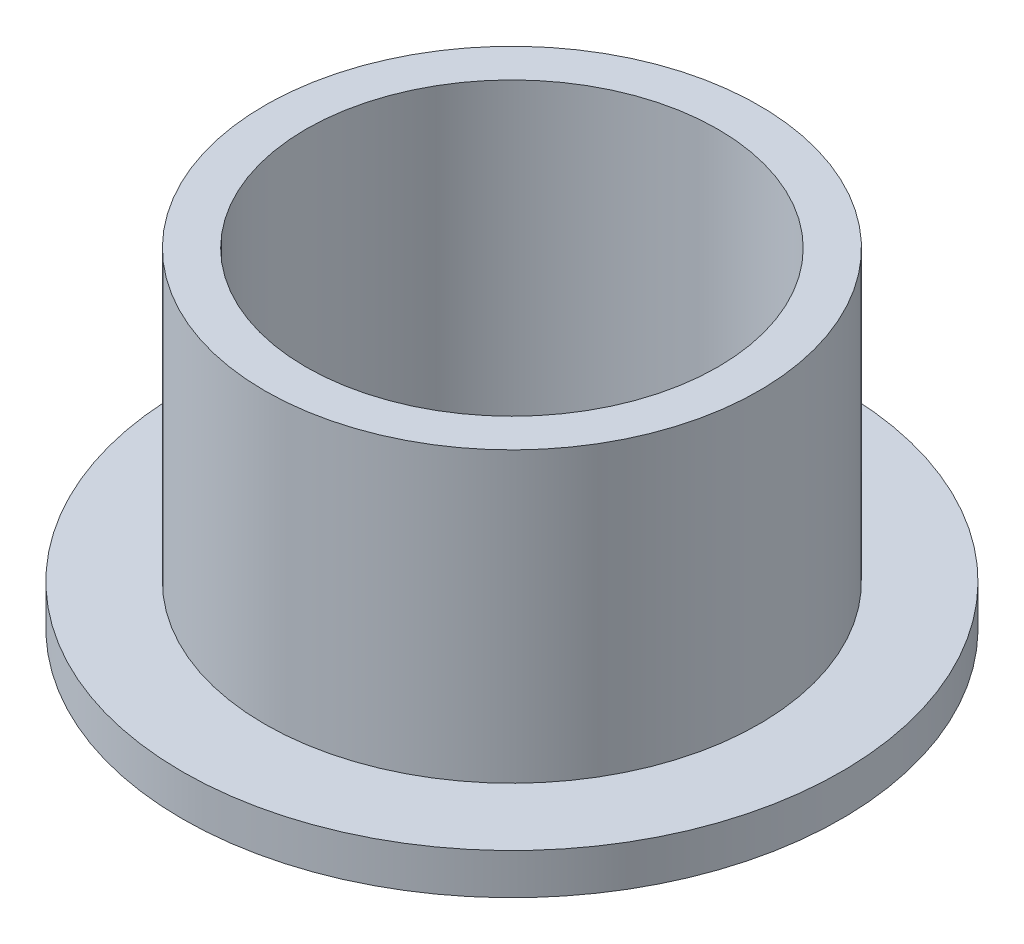
ISO-10303-21;
HEADER;
FILE_DESCRIPTION(('STEP AP214'),'2;1');
FILE_NAME('part.step','',(''),(''),'','','');
FILE_SCHEMA(('AUTOMOTIVE_DESIGN { 1 0 10303 214 1 1 1 1 }'));
ENDSEC;
DATA;
#1=APPLICATION_CONTEXT('core data for automotive mechanical design processes');
#2=APPLICATION_PROTOCOL_DEFINITION('international standard','automotive_design',2000,#1);
#3=PRODUCT_CONTEXT('',#1,'mechanical');
#4=PRODUCT('Part','Part','',(#3));
#5=PRODUCT_RELATED_PRODUCT_CATEGORY('part','',(#4));
#6=PRODUCT_DEFINITION_FORMATION('','',#4);
#7=PRODUCT_DEFINITION_CONTEXT('part definition',#1,'design');
#8=PRODUCT_DEFINITION('design','',#6,#7);
#9=PRODUCT_DEFINITION_SHAPE('','',#8);
#10=(LENGTH_UNIT() NAMED_UNIT(*) SI_UNIT(.MILLI.,.METRE.));
#11=(NAMED_UNIT(*) PLANE_ANGLE_UNIT() SI_UNIT($,.RADIAN.));
#12=(NAMED_UNIT(*) SI_UNIT($,.STERADIAN.) SOLID_ANGLE_UNIT());
#13=UNCERTAINTY_MEASURE_WITH_UNIT(LENGTH_MEASURE(1.E-05),#10,'distance_accuracy_value','');
#14=(GEOMETRIC_REPRESENTATION_CONTEXT(3) GLOBAL_UNCERTAINTY_ASSIGNED_CONTEXT((#13)) GLOBAL_UNIT_ASSIGNED_CONTEXT((#10,
#11,#12)) REPRESENTATION_CONTEXT('',''));
#15=CARTESIAN_POINT('',(0.,0.,0.));
#16=DIRECTION('',(0.,0.,1.));
#17=DIRECTION('',(1.,0.,0.));
#18=AXIS2_PLACEMENT_3D('',#15,#16,#17);
#19=CARTESIAN_POINT('',(0.,26.7127403846154,0.));
#20=DIRECTION('',(0.,1.,0.));
#21=DIRECTION('',(0.,0.,1.));
#22=AXIS2_PLACEMENT_3D('',#19,#20,#21);
#23=CYLINDRICAL_SURFACE('',#22,7.9375);
#24=CARTESIAN_POINT('',(0.,0.,0.));
#25=DIRECTION('',(0.,1.,0.));
#26=DIRECTION('',(0.,0.,1.));
#27=AXIS2_PLACEMENT_3D('',#24,#25,#26);
#28=CIRCLE('',#27,7.9375);
#29=CARTESIAN_POINT('',(0.,0.,7.9375));
#30=VERTEX_POINT('',#29);
#31=EDGE_CURVE('E10',#30,#30,#28,.T.);
#32=ORIENTED_EDGE('',*,*,#31,.F.);
#33=EDGE_LOOP('',(#32));
#34=FACE_BOUND('',#33,.T.);
#35=CARTESIAN_POINT('',(0.,12.7,0.));
#36=DIRECTION('',(0.,1.,0.));
#37=DIRECTION('',(0.,0.,1.));
#38=AXIS2_PLACEMENT_3D('',#35,#36,#37);
#39=CIRCLE('',#38,7.9375);
#40=CARTESIAN_POINT('',(0.,12.7,7.9375));
#41=VERTEX_POINT('',#40);
#42=EDGE_CURVE('E53',#41,#41,#39,.T.);
#43=ORIENTED_EDGE('',*,*,#42,.T.);
#44=EDGE_LOOP('',(#43));
#45=FACE_BOUND('',#44,.T.);
#46=ADVANCED_FACE('F31',(#34,#45),#23,.F.);
#47=CARTESIAN_POINT('',(7.9375,0.,0.));
#48=DIRECTION('',(0.,1.,0.));
#49=DIRECTION('',(0.,0.,1.));
#50=AXIS2_PLACEMENT_3D('',#47,#48,#49);
#51=PLANE('',#50);
#52=CARTESIAN_POINT('',(0.,0.,0.));
#53=DIRECTION('',(0.,1.,0.));
#54=DIRECTION('',(0.,0.,1.));
#55=AXIS2_PLACEMENT_3D('',#52,#53,#54);
#56=CIRCLE('',#55,12.7);
#57=CARTESIAN_POINT('',(0.,0.,12.7));
#58=VERTEX_POINT('',#57);
#59=EDGE_CURVE('E37',#58,#58,#56,.T.);
#60=ORIENTED_EDGE('',*,*,#59,.F.);
#61=EDGE_LOOP('',(#60));
#62=FACE_BOUND('',#61,.T.);
#63=ORIENTED_EDGE('',*,*,#31,.T.);
#64=EDGE_LOOP('',(#63));
#65=FACE_BOUND('',#64,.T.);
#66=ADVANCED_FACE('F78',(#62,#65),#51,.F.);
#67=CARTESIAN_POINT('',(0.,26.7127403846154,0.));
#68=DIRECTION('',(0.,1.,0.));
#69=DIRECTION('',(0.,0.,1.));
#70=AXIS2_PLACEMENT_3D('',#67,#68,#69);
#71=CYLINDRICAL_SURFACE('',#70,12.7);
#72=CARTESIAN_POINT('',(0.,1.5748,0.));
#73=DIRECTION('',(0.,1.,0.));
#74=DIRECTION('',(0.,0.,1.));
#75=AXIS2_PLACEMENT_3D('',#72,#73,#74);
#76=CIRCLE('',#75,12.7);
#77=CARTESIAN_POINT('',(0.,1.5748,12.7));
#78=VERTEX_POINT('',#77);
#79=EDGE_CURVE('E41',#78,#78,#76,.T.);
#80=ORIENTED_EDGE('',*,*,#79,.F.);
#81=EDGE_LOOP('',(#80));
#82=FACE_BOUND('',#81,.T.);
#83=ORIENTED_EDGE('',*,*,#59,.T.);
#84=EDGE_LOOP('',(#83));
#85=FACE_BOUND('',#84,.T.);
#86=ADVANCED_FACE('F73',(#82,#85),#71,.T.);
#87=CARTESIAN_POINT('',(12.7,1.5748,0.));
#88=DIRECTION('',(0.,-1.,0.));
#89=DIRECTION('',(0.,0.,-1.));
#90=AXIS2_PLACEMENT_3D('',#87,#88,#89);
#91=PLANE('',#90);
#92=CARTESIAN_POINT('',(0.,1.5748,0.));
#93=DIRECTION('',(0.,1.,0.));
#94=DIRECTION('',(0.,0.,1.));
#95=AXIS2_PLACEMENT_3D('',#92,#93,#94);
#96=CIRCLE('',#95,9.525);
#97=CARTESIAN_POINT('',(0.,1.5748,9.525));
#98=VERTEX_POINT('',#97);
#99=EDGE_CURVE('E45',#98,#98,#96,.T.);
#100=ORIENTED_EDGE('',*,*,#99,.F.);
#101=EDGE_LOOP('',(#100));
#102=FACE_BOUND('',#101,.T.);
#103=ORIENTED_EDGE('',*,*,#79,.T.);
#104=EDGE_LOOP('',(#103));
#105=FACE_BOUND('',#104,.T.);
#106=ADVANCED_FACE('F67',(#102,#105),#91,.F.);
#107=CARTESIAN_POINT('',(0.,26.7127403846154,0.));
#108=DIRECTION('',(0.,1.,0.));
#109=DIRECTION('',(0.,0.,1.));
#110=AXIS2_PLACEMENT_3D('',#107,#108,#109);
#111=CYLINDRICAL_SURFACE('',#110,9.525);
#112=CARTESIAN_POINT('',(0.,12.7,0.));
#113=DIRECTION('',(0.,1.,0.));
#114=DIRECTION('',(0.,0.,1.));
#115=AXIS2_PLACEMENT_3D('',#112,#113,#114);
#116=CIRCLE('',#115,9.525);
#117=CARTESIAN_POINT('',(0.,12.7,9.525));
#118=VERTEX_POINT('',#117);
#119=EDGE_CURVE('E50',#118,#118,#116,.T.);
#120=ORIENTED_EDGE('',*,*,#119,.F.);
#121=EDGE_LOOP('',(#120));
#122=FACE_BOUND('',#121,.T.);
#123=ORIENTED_EDGE('',*,*,#99,.T.);
#124=EDGE_LOOP('',(#123));
#125=FACE_BOUND('',#124,.T.);
#126=ADVANCED_FACE('F61',(#122,#125),#111,.T.);
#127=CARTESIAN_POINT('',(9.525,12.7,0.));
#128=DIRECTION('',(0.,-1.,0.));
#129=DIRECTION('',(0.,0.,-1.));
#130=AXIS2_PLACEMENT_3D('',#127,#128,#129);
#131=PLANE('',#130);
#132=ORIENTED_EDGE('',*,*,#42,.F.);
#133=EDGE_LOOP('',(#132));
#134=FACE_BOUND('',#133,.T.);
#135=ORIENTED_EDGE('',*,*,#119,.T.);
#136=EDGE_LOOP('',(#135));
#137=FACE_BOUND('',#136,.T.);
#138=ADVANCED_FACE('F58',(#134,#137),#131,.F.);
#139=CLOSED_SHELL('',(#46,#66,#86,#106,#126,#138));
#140=MANIFOLD_SOLID_BREP('B2',#139);
#141=ADVANCED_BREP_SHAPE_REPRESENTATION('',(#18,#140),#14);
#142=SHAPE_DEFINITION_REPRESENTATION(#9,#141);
ENDSEC;
END-ISO-10303-21;
